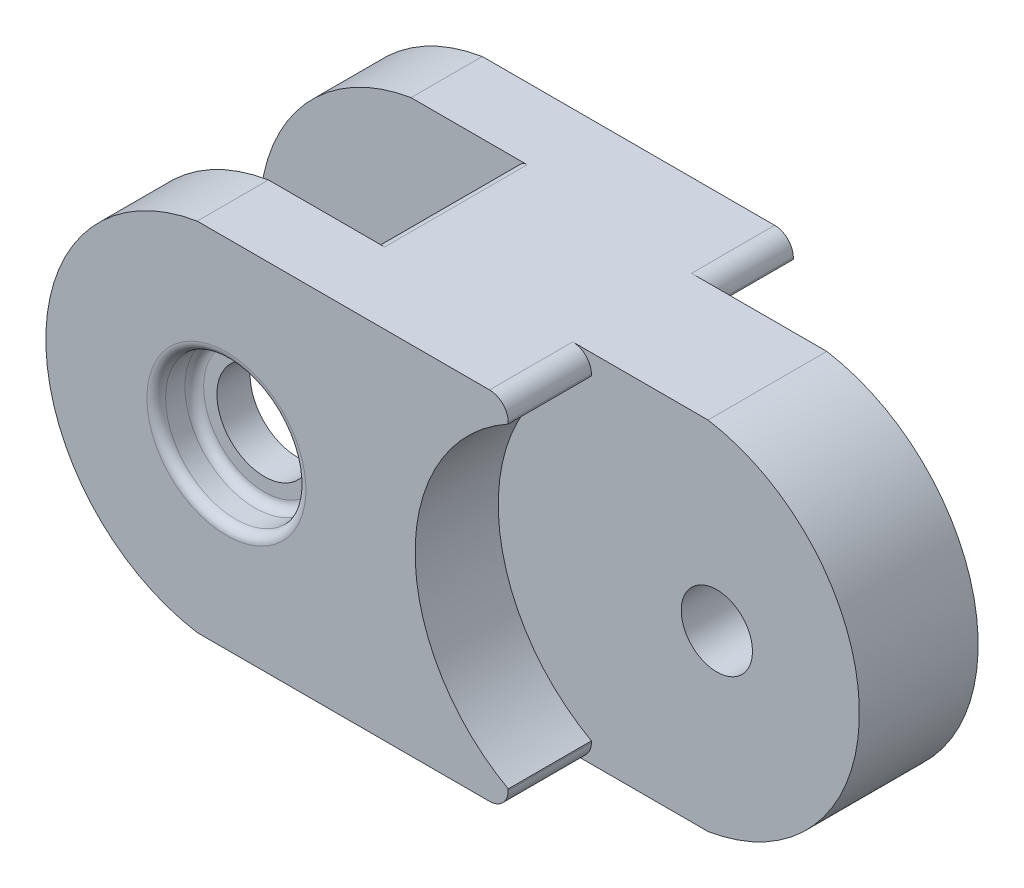
ISO-10303-21;
HEADER;
FILE_DESCRIPTION(('STEP AP214'),'2;1');
FILE_NAME('part.step','',(''),(''),'','','');
FILE_SCHEMA(('AUTOMOTIVE_DESIGN { 1 0 10303 214 1 1 1 1 }'));
ENDSEC;
DATA;
#1=APPLICATION_CONTEXT('core data for automotive mechanical design processes');
#2=APPLICATION_PROTOCOL_DEFINITION('international standard','automotive_design',2000,#1);
#3=PRODUCT_CONTEXT('',#1,'mechanical');
#4=PRODUCT('Part','Part','',(#3));
#5=PRODUCT_RELATED_PRODUCT_CATEGORY('part','',(#4));
#6=PRODUCT_DEFINITION_FORMATION('','',#4);
#7=PRODUCT_DEFINITION_CONTEXT('part definition',#1,'design');
#8=PRODUCT_DEFINITION('design','',#6,#7);
#9=PRODUCT_DEFINITION_SHAPE('','',#8);
#10=(LENGTH_UNIT() NAMED_UNIT(*) SI_UNIT(.MILLI.,.METRE.));
#11=(NAMED_UNIT(*) PLANE_ANGLE_UNIT() SI_UNIT($,.RADIAN.));
#12=(NAMED_UNIT(*) SI_UNIT($,.STERADIAN.) SOLID_ANGLE_UNIT());
#13=UNCERTAINTY_MEASURE_WITH_UNIT(LENGTH_MEASURE(1.E-05),#10,'distance_accuracy_value','');
#14=(GEOMETRIC_REPRESENTATION_CONTEXT(3) GLOBAL_UNCERTAINTY_ASSIGNED_CONTEXT((#13)) GLOBAL_UNIT_ASSIGNED_CONTEXT((#10,
#11,#12)) REPRESENTATION_CONTEXT('',''));
#15=CARTESIAN_POINT('',(0.,0.,0.));
#16=DIRECTION('',(0.,0.,1.));
#17=DIRECTION('',(1.,0.,0.));
#18=AXIS2_PLACEMENT_3D('',#15,#16,#17);
#19=CARTESIAN_POINT('',(0.,19.05,0.));
#20=DIRECTION('',(0.,-1.,0.));
#21=DIRECTION('',(0.,0.,-1.));
#22=AXIS2_PLACEMENT_3D('',#19,#20,#21);
#23=PLANE('',#22);
#24=DIRECTION('',(-1.,0.,0.));
#25=VECTOR('',#24,1.);
#26=CARTESIAN_POINT('',(0.,19.05,-3.175));
#27=LINE('',#26,#25);
#28=CARTESIAN_POINT('',(11.43,19.05,-3.175));
#29=VERTEX_POINT('',#28);
#30=CARTESIAN_POINT('',(4.19698559221496,19.05,-3.175));
#31=VERTEX_POINT('',#30);
#32=EDGE_CURVE('E223',#29,#31,#27,.T.);
#33=ORIENTED_EDGE('',*,*,#32,.T.);
#34=DIRECTION('',(0.,0.,1.));
#35=VECTOR('',#34,1.);
#36=CARTESIAN_POINT('',(4.19698559221496,19.05,0.));
#37=LINE('',#36,#35);
#38=CARTESIAN_POINT('',(4.19698559221496,19.05,-7.62));
#39=VERTEX_POINT('',#38);
#40=EDGE_CURVE('E364',#31,#39,#37,.F.);
#41=ORIENTED_EDGE('',*,*,#40,.T.);
#42=DIRECTION('',(1.,0.,0.));
#43=VECTOR('',#42,1.);
#44=CARTESIAN_POINT('',(-11.43,19.05,-7.62));
#45=LINE('',#44,#43);
#46=CARTESIAN_POINT('',(-11.43,19.05,-7.62));
#47=VERTEX_POINT('',#46);
#48=EDGE_CURVE('E288',#47,#39,#45,.T.);
#49=ORIENTED_EDGE('',*,*,#48,.F.);
#50=DIRECTION('',(0.,0.,1.));
#51=VECTOR('',#50,1.);
#52=CARTESIAN_POINT('',(-11.43,19.05,-7.62));
#53=LINE('',#52,#51);
#54=CARTESIAN_POINT('',(-11.43,19.05,-3.81));
#55=VERTEX_POINT('',#54);
#56=EDGE_CURVE('E273',#47,#55,#53,.T.);
#57=ORIENTED_EDGE('',*,*,#56,.T.);
#58=DIRECTION('',(1.,0.,0.));
#59=VECTOR('',#58,1.);
#60=CARTESIAN_POINT('',(0.,19.05,-3.81));
#61=LINE('',#60,#59);
#62=CARTESIAN_POINT('',(-5.22047552437083,19.05,-3.81));
#63=VERTEX_POINT('',#62);
#64=EDGE_CURVE('E262',#55,#63,#61,.T.);
#65=ORIENTED_EDGE('',*,*,#64,.T.);
#66=DIRECTION('',(0.,0.,1.));
#67=VECTOR('',#66,1.);
#68=CARTESIAN_POINT('',(-5.22047552437083,19.05,0.));
#69=LINE('',#68,#67);
#70=CARTESIAN_POINT('',(-5.22047552437083,19.05,3.81));
#71=VERTEX_POINT('',#70);
#72=EDGE_CURVE('E316',#63,#71,#69,.T.);
#73=ORIENTED_EDGE('',*,*,#72,.T.);
#74=DIRECTION('',(1.,0.,0.));
#75=VECTOR('',#74,1.);
#76=CARTESIAN_POINT('',(0.,19.05,3.81));
#77=LINE('',#76,#75);
#78=CARTESIAN_POINT('',(-11.43,19.05,3.81));
#79=VERTEX_POINT('',#78);
#80=EDGE_CURVE('E258',#79,#71,#77,.T.);
#81=ORIENTED_EDGE('',*,*,#80,.F.);
#82=DIRECTION('',(0.,0.,-1.));
#83=VECTOR('',#82,1.);
#84=CARTESIAN_POINT('',(-11.43,19.05,7.62));
#85=LINE('',#84,#83);
#86=CARTESIAN_POINT('',(-11.43,19.05,7.62));
#87=VERTEX_POINT('',#86);
#88=EDGE_CURVE('E285',#87,#79,#85,.T.);
#89=ORIENTED_EDGE('',*,*,#88,.F.);
#90=DIRECTION('',(1.,0.,0.));
#91=VECTOR('',#90,1.);
#92=CARTESIAN_POINT('',(-11.43,19.05,7.62));
#93=LINE('',#92,#91);
#94=CARTESIAN_POINT('',(4.19698559221499,19.05,7.62));
#95=VERTEX_POINT('',#94);
#96=EDGE_CURVE('E292',#87,#95,#93,.T.);
#97=ORIENTED_EDGE('',*,*,#96,.T.);
#98=DIRECTION('',(0.,0.,1.));
#99=VECTOR('',#98,1.);
#100=CARTESIAN_POINT('',(4.19698559221499,19.05,0.));
#101=LINE('',#100,#99);
#102=CARTESIAN_POINT('',(4.19698559221499,19.05,3.175));
#103=VERTEX_POINT('',#102);
#104=EDGE_CURVE('E361',#95,#103,#101,.F.);
#105=ORIENTED_EDGE('',*,*,#104,.T.);
#106=DIRECTION('',(-1.,0.,0.));
#107=VECTOR('',#106,1.);
#108=CARTESIAN_POINT('',(0.,19.05,3.175));
#109=LINE('',#108,#107);
#110=CARTESIAN_POINT('',(11.43,19.05,3.175));
#111=VERTEX_POINT('',#110);
#112=EDGE_CURVE('E233',#111,#103,#109,.T.);
#113=ORIENTED_EDGE('',*,*,#112,.F.);
#114=DIRECTION('',(0.,0.,-1.));
#115=VECTOR('',#114,1.);
#116=CARTESIAN_POINT('',(11.43,19.05,3.175));
#117=LINE('',#116,#115);
#118=EDGE_CURVE('E247',#111,#29,#117,.T.);
#119=ORIENTED_EDGE('',*,*,#118,.T.);
#120=EDGE_LOOP('',(#33,#41,#49,#57,#65,#73,#81,#89,#97,#105,#113,#119));
#121=FACE_BOUND('',#120,.T.);
#122=ADVANCED_FACE('F38',(#121),#23,.F.);
#123=CARTESIAN_POINT('',(0.,0.,0.));
#124=DIRECTION('',(0.,-1.,0.));
#125=DIRECTION('',(0.,0.,-1.));
#126=AXIS2_PLACEMENT_3D('',#123,#124,#125);
#127=PLANE('',#126);
#128=DIRECTION('',(1.,0.,0.));
#129=VECTOR('',#128,1.);
#130=CARTESIAN_POINT('',(-11.43,0.,-7.62));
#131=LINE('',#130,#129);
#132=CARTESIAN_POINT('',(-11.43,0.,-7.62));
#133=VERTEX_POINT('',#132);
#134=CARTESIAN_POINT('',(4.19698559221496,0.,-7.62));
#135=VERTEX_POINT('',#134);
#136=EDGE_CURVE('E298',#133,#135,#131,.T.);
#137=ORIENTED_EDGE('',*,*,#136,.T.);
#138=DIRECTION('',(0.,0.,1.));
#139=VECTOR('',#138,1.);
#140=CARTESIAN_POINT('',(4.19698559221496,0.,-3.175));
#141=LINE('',#140,#139);
#142=CARTESIAN_POINT('',(4.19698559221496,0.,-3.175));
#143=VERTEX_POINT('',#142);
#144=EDGE_CURVE('E350',#135,#143,#141,.T.);
#145=ORIENTED_EDGE('',*,*,#144,.T.);
#146=DIRECTION('',(-1.,0.,0.));
#147=VECTOR('',#146,1.);
#148=CARTESIAN_POINT('',(0.,0.,-3.175));
#149=LINE('',#148,#147);
#150=CARTESIAN_POINT('',(11.43,0.,-3.175));
#151=VERTEX_POINT('',#150);
#152=EDGE_CURVE('E216',#151,#143,#149,.T.);
#153=ORIENTED_EDGE('',*,*,#152,.F.);
#154=DIRECTION('',(0.,0.,-1.));
#155=VECTOR('',#154,1.);
#156=CARTESIAN_POINT('',(11.43,0.,3.175));
#157=LINE('',#156,#155);
#158=CARTESIAN_POINT('',(11.43,0.,3.175));
#159=VERTEX_POINT('',#158);
#160=EDGE_CURVE('E242',#159,#151,#157,.T.);
#161=ORIENTED_EDGE('',*,*,#160,.F.);
#162=DIRECTION('',(-1.,0.,0.));
#163=VECTOR('',#162,1.);
#164=CARTESIAN_POINT('',(0.,0.,3.175));
#165=LINE('',#164,#163);
#166=CARTESIAN_POINT('',(4.19698559221499,0.,3.175));
#167=VERTEX_POINT('',#166);
#168=EDGE_CURVE('E229',#159,#167,#165,.T.);
#169=ORIENTED_EDGE('',*,*,#168,.T.);
#170=DIRECTION('',(0.,0.,1.));
#171=VECTOR('',#170,1.);
#172=CARTESIAN_POINT('',(4.19698559221499,0.,7.62));
#173=LINE('',#172,#171);
#174=CARTESIAN_POINT('',(4.19698559221499,0.,7.62));
#175=VERTEX_POINT('',#174);
#176=EDGE_CURVE('E347',#167,#175,#173,.T.);
#177=ORIENTED_EDGE('',*,*,#176,.T.);
#178=DIRECTION('',(1.,0.,0.));
#179=VECTOR('',#178,1.);
#180=CARTESIAN_POINT('',(-11.43,0.,7.62));
#181=LINE('',#180,#179);
#182=CARTESIAN_POINT('',(-11.43,0.,7.62));
#183=VERTEX_POINT('',#182);
#184=EDGE_CURVE('E289',#183,#175,#181,.T.);
#185=ORIENTED_EDGE('',*,*,#184,.F.);
#186=DIRECTION('',(0.,0.,-1.));
#187=VECTOR('',#186,1.);
#188=CARTESIAN_POINT('',(-11.43,0.,7.62));
#189=LINE('',#188,#187);
#190=CARTESIAN_POINT('',(-11.43,0.,3.81));
#191=VERTEX_POINT('',#190);
#192=EDGE_CURVE('E282',#183,#191,#189,.T.);
#193=ORIENTED_EDGE('',*,*,#192,.T.);
#194=DIRECTION('',(1.,0.,0.));
#195=VECTOR('',#194,1.);
#196=CARTESIAN_POINT('',(0.,0.,3.81));
#197=LINE('',#196,#195);
#198=CARTESIAN_POINT('',(-5.22047552437083,0.,3.81));
#199=VERTEX_POINT('',#198);
#200=EDGE_CURVE('E254',#191,#199,#197,.T.);
#201=ORIENTED_EDGE('',*,*,#200,.T.);
#202=DIRECTION('',(0.,0.,-1.));
#203=VECTOR('',#202,1.);
#204=CARTESIAN_POINT('',(-5.22047552437083,0.,-3.81));
#205=LINE('',#204,#203);
#206=CARTESIAN_POINT('',(-5.22047552437083,0.,-3.81));
#207=VERTEX_POINT('',#206);
#208=EDGE_CURVE('E313',#199,#207,#205,.T.);
#209=ORIENTED_EDGE('',*,*,#208,.T.);
#210=DIRECTION('',(1.,0.,0.));
#211=VECTOR('',#210,1.);
#212=CARTESIAN_POINT('',(0.,0.,-3.81));
#213=LINE('',#212,#211);
#214=CARTESIAN_POINT('',(-11.43,0.,-3.81));
#215=VERTEX_POINT('',#214);
#216=EDGE_CURVE('E260',#215,#207,#213,.T.);
#217=ORIENTED_EDGE('',*,*,#216,.F.);
#218=DIRECTION('',(0.,0.,1.));
#219=VECTOR('',#218,1.);
#220=CARTESIAN_POINT('',(-11.43,0.,-7.62));
#221=LINE('',#220,#219);
#222=EDGE_CURVE('E270',#133,#215,#221,.T.);
#223=ORIENTED_EDGE('',*,*,#222,.F.);
#224=EDGE_LOOP('',(#137,#145,#153,#161,#169,#177,#185,#193,#201,#209,#217,#223));
#225=FACE_BOUND('',#224,.T.);
#226=ADVANCED_FACE('F389',(#225),#127,.T.);
#227=CARTESIAN_POINT('',(-11.43,19.05,-7.62));
#228=DIRECTION('',(0.,0.,-1.));
#229=DIRECTION('',(-1.,0.,0.));
#230=AXIS2_PLACEMENT_3D('',#227,#228,#229);
#231=PLANE('',#230);
#232=DIRECTION('',(0.,1.,0.));
#233=VECTOR('',#232,1.);
#234=CARTESIAN_POINT('',(5.19698559221496,-5.4259918382174,-7.62));
#235=LINE('',#234,#233);
#236=CARTESIAN_POINT('',(5.19698559221496,0.999999999999998,-7.62));
#237=VERTEX_POINT('',#236);
#238=CARTESIAN_POINT('',(5.19698559221497,1.07931071599416,-7.62));
#239=VERTEX_POINT('',#238);
#240=EDGE_CURVE('E186',#237,#239,#235,.T.);
#241=ORIENTED_EDGE('',*,*,#240,.F.);
#242=CARTESIAN_POINT('',(4.19698559221496,1.,-7.62));
#243=DIRECTION('',(0.,0.,-1.));
#244=DIRECTION('',(-1.,0.,0.));
#245=AXIS2_PLACEMENT_3D('',#242,#243,#244);
#246=CIRCLE('',#245,1.);
#247=EDGE_CURVE('E356',#237,#135,#246,.T.);
#248=ORIENTED_EDGE('',*,*,#247,.T.);
#249=ORIENTED_EDGE('',*,*,#136,.F.);
#250=CARTESIAN_POINT('',(-9.86939787261456,9.525,-7.62));
#251=DIRECTION('',(0.,0.,1.));
#252=DIRECTION('',(1.,0.,0.));
#253=AXIS2_PLACEMENT_3D('',#250,#251,#252);
#254=CIRCLE('',#253,9.652);
#255=EDGE_CURVE('E268',#47,#133,#254,.T.);
#256=ORIENTED_EDGE('',*,*,#255,.F.);
#257=ORIENTED_EDGE('',*,*,#48,.T.);
#258=CARTESIAN_POINT('',(4.19698559221496,18.05,-7.62));
#259=DIRECTION('',(0.,0.,-1.));
#260=DIRECTION('',(-1.,0.,0.));
#261=AXIS2_PLACEMENT_3D('',#258,#259,#260);
#262=CIRCLE('',#261,1.);
#263=CARTESIAN_POINT('',(5.19698559221496,18.05,-7.62));
#264=VERTEX_POINT('',#263);
#265=EDGE_CURVE('E354',#39,#264,#262,.T.);
#266=ORIENTED_EDGE('',*,*,#265,.T.);
#267=CARTESIAN_POINT('',(5.19698559221497,17.9706892840058,-7.62));
#268=VERTEX_POINT('',#267);
#269=EDGE_CURVE('E198',#268,#264,#235,.T.);
#270=ORIENTED_EDGE('',*,*,#269,.F.);
#271=CARTESIAN_POINT('',(9.86939787261456,9.525,-7.62));
#272=DIRECTION('',(0.,0.,1.));
#273=DIRECTION('',(1.,0.,0.));
#274=AXIS2_PLACEMENT_3D('',#271,#272,#273);
#275=CIRCLE('',#274,9.652);
#276=EDGE_CURVE('E204',#268,#239,#275,.T.);
#277=ORIENTED_EDGE('',*,*,#276,.T.);
#278=EDGE_LOOP('',(#241,#248,#249,#256,#257,#266,#270,#277));
#279=FACE_BOUND('',#278,.T.);
#280=CARTESIAN_POINT('',(-9.86939787261456,9.525,-7.62));
#281=DIRECTION('',(0.,0.,1.));
#282=DIRECTION('',(1.,0.,0.));
#283=AXIS2_PLACEMENT_3D('',#280,#281,#282);
#284=CIRCLE('',#283,1.905);
#285=CARTESIAN_POINT('',(-7.96439787261455,9.525,-7.62));
#286=VERTEX_POINT('',#285);
#287=EDGE_CURVE('E264',#286,#286,#284,.T.);
#288=ORIENTED_EDGE('',*,*,#287,.T.);
#289=EDGE_LOOP('',(#288));
#290=FACE_BOUND('',#289,.T.);
#291=ADVANCED_FACE('F211',(#279,#290),#231,.T.);
#292=CARTESIAN_POINT('',(-11.43,19.05,7.62));
#293=DIRECTION('',(0.,0.,-1.));
#294=DIRECTION('',(-1.,0.,0.));
#295=AXIS2_PLACEMENT_3D('',#292,#293,#294);
#296=PLANE('',#295);
#297=CARTESIAN_POINT('',(-9.86939787261456,9.525,7.62));
#298=DIRECTION('',(0.,0.,-1.));
#299=DIRECTION('',(-1.,0.,0.));
#300=AXIS2_PLACEMENT_3D('',#297,#298,#299);
#301=CIRCLE('',#300,4.2500052);
#302=CARTESIAN_POINT('',(-14.1194030726146,9.525,7.62));
#303=VERTEX_POINT('',#302);
#304=EDGE_CURVE('E338',#303,#303,#301,.T.);
#305=ORIENTED_EDGE('',*,*,#304,.T.);
#306=EDGE_LOOP('',(#305));
#307=FACE_BOUND('',#306,.T.);
#308=ORIENTED_EDGE('',*,*,#184,.T.);
#309=CARTESIAN_POINT('',(4.19698559221499,1.,7.62));
#310=DIRECTION('',(0.,0.,-1.));
#311=DIRECTION('',(-1.,0.,0.));
#312=AXIS2_PLACEMENT_3D('',#309,#310,#311);
#313=CIRCLE('',#312,1.);
#314=CARTESIAN_POINT('',(5.19698559221499,1.,7.62));
#315=VERTEX_POINT('',#314);
#316=EDGE_CURVE('E368',#175,#315,#313,.F.);
#317=ORIENTED_EDGE('',*,*,#316,.T.);
#318=DIRECTION('',(0.,1.,0.));
#319=VECTOR('',#318,1.);
#320=CARTESIAN_POINT('',(5.19698559221499,-5.4259918382174,7.62));
#321=LINE('',#320,#319);
#322=CARTESIAN_POINT('',(5.19698559221499,1.07931071599415,7.62));
#323=VERTEX_POINT('',#322);
#324=EDGE_CURVE('E440',#315,#323,#321,.T.);
#325=ORIENTED_EDGE('',*,*,#324,.T.);
#326=CARTESIAN_POINT('',(9.86939787261456,9.525,7.62));
#327=DIRECTION('',(0.,0.,1.));
#328=DIRECTION('',(1.,0.,0.));
#329=AXIS2_PLACEMENT_3D('',#326,#327,#328);
#330=CIRCLE('',#329,9.652);
#331=CARTESIAN_POINT('',(5.19698559221499,17.9706892840059,7.62));
#332=VERTEX_POINT('',#331);
#333=EDGE_CURVE('E226',#332,#323,#330,.T.);
#334=ORIENTED_EDGE('',*,*,#333,.F.);
#335=CARTESIAN_POINT('',(5.19698559221499,18.05,7.62));
#336=VERTEX_POINT('',#335);
#337=EDGE_CURVE('E197',#332,#336,#321,.T.);
#338=ORIENTED_EDGE('',*,*,#337,.T.);
#339=CARTESIAN_POINT('',(4.19698559221499,18.05,7.62));
#340=DIRECTION('',(0.,0.,-1.));
#341=DIRECTION('',(-1.,0.,0.));
#342=AXIS2_PLACEMENT_3D('',#339,#340,#341);
#343=CIRCLE('',#342,1.);
#344=EDGE_CURVE('E366',#336,#95,#343,.F.);
#345=ORIENTED_EDGE('',*,*,#344,.T.);
#346=ORIENTED_EDGE('',*,*,#96,.F.);
#347=CARTESIAN_POINT('',(-9.86939787261456,9.525,7.62));
#348=DIRECTION('',(0.,0.,1.));
#349=DIRECTION('',(1.,0.,0.));
#350=AXIS2_PLACEMENT_3D('',#347,#348,#349);
#351=CIRCLE('',#350,9.652);
#352=EDGE_CURVE('E276',#87,#183,#351,.T.);
#353=ORIENTED_EDGE('',*,*,#352,.T.);
#354=EDGE_LOOP('',(#308,#317,#325,#334,#338,#345,#346,#353));
#355=FACE_BOUND('',#354,.T.);
#356=ADVANCED_FACE('F391',(#307,#355),#296,.F.);
#357=CARTESIAN_POINT('',(-9.86939787261456,9.525,3.81));
#358=DIRECTION('',(0.,0.,1.));
#359=DIRECTION('',(1.,0.,0.));
#360=AXIS2_PLACEMENT_3D('',#357,#358,#359);
#361=CYLINDRICAL_SURFACE('',#360,9.652);
#362=ORIENTED_EDGE('',*,*,#352,.F.);
#363=ORIENTED_EDGE('',*,*,#88,.T.);
#364=CARTESIAN_POINT('',(-9.86939787261456,9.525,3.81));
#365=DIRECTION('',(0.,0.,1.));
#366=DIRECTION('',(1.,0.,0.));
#367=AXIS2_PLACEMENT_3D('',#364,#365,#366);
#368=CIRCLE('',#367,9.652);
#369=EDGE_CURVE('E279',#79,#191,#368,.T.);
#370=ORIENTED_EDGE('',*,*,#369,.T.);
#371=ORIENTED_EDGE('',*,*,#192,.F.);
#372=EDGE_LOOP('',(#362,#363,#370,#371));
#373=FACE_BOUND('',#372,.T.);
#374=ADVANCED_FACE('F395',(#373),#361,.T.);
#375=CARTESIAN_POINT('',(-9.86939787261456,9.525,3.81));
#376=DIRECTION('',(0.,0.,1.));
#377=DIRECTION('',(1.,0.,0.));
#378=AXIS2_PLACEMENT_3D('',#375,#376,#377);
#379=PLANE('',#378);
#380=CARTESIAN_POINT('',(-9.86939787261456,9.525,3.81));
#381=DIRECTION('',(0.,0.,1.));
#382=DIRECTION('',(1.,0.,0.));
#383=AXIS2_PLACEMENT_3D('',#380,#381,#382);
#384=CIRCLE('',#383,2.54);
#385=CARTESIAN_POINT('',(-7.32939787261455,9.525,3.81));
#386=VERTEX_POINT('',#385);
#387=EDGE_CURVE('E214',#386,#386,#384,.F.);
#388=ORIENTED_EDGE('',*,*,#387,.F.);
#389=EDGE_LOOP('',(#388));
#390=FACE_BOUND('',#389,.T.);
#391=ORIENTED_EDGE('',*,*,#369,.F.);
#392=ORIENTED_EDGE('',*,*,#80,.T.);
#393=CARTESIAN_POINT('',(-5.22047552437083,18.55,3.81));
#394=DIRECTION('',(0.,0.,1.));
#395=DIRECTION('',(1.,0.,0.));
#396=AXIS2_PLACEMENT_3D('',#393,#394,#395);
#397=CIRCLE('',#396,0.5);
#398=CARTESIAN_POINT('',(-5.44944136106526,18.1055063041765,3.81));
#399=VERTEX_POINT('',#398);
#400=EDGE_CURVE('E324',#71,#399,#397,.T.);
#401=ORIENTED_EDGE('',*,*,#400,.T.);
#402=CARTESIAN_POINT('',(-9.86939787261455,9.525,3.81));
#403=DIRECTION('',(0.,0.,1.));
#404=DIRECTION('',(-1.,0.,0.));
#405=AXIS2_PLACEMENT_3D('',#402,#403,#404);
#406=CIRCLE('',#405,9.652);
#407=CARTESIAN_POINT('',(-5.44944136106526,0.944493695823483,3.81));
#408=VERTEX_POINT('',#407);
#409=EDGE_CURVE('E250',#408,#399,#406,.T.);
#410=ORIENTED_EDGE('',*,*,#409,.F.);
#411=CARTESIAN_POINT('',(-5.22047552437083,0.5,3.81));
#412=DIRECTION('',(0.,0.,1.));
#413=DIRECTION('',(1.,0.,0.));
#414=AXIS2_PLACEMENT_3D('',#411,#412,#413);
#415=CIRCLE('',#414,0.5);
#416=EDGE_CURVE('E319',#408,#199,#415,.T.);
#417=ORIENTED_EDGE('',*,*,#416,.T.);
#418=ORIENTED_EDGE('',*,*,#200,.F.);
#419=EDGE_LOOP('',(#391,#392,#401,#410,#417,#418));
#420=FACE_BOUND('',#419,.T.);
#421=ADVANCED_FACE('F401',(#390,#420),#379,.F.);
#422=CARTESIAN_POINT('',(-9.86939787261456,9.525,-7.62));
#423=DIRECTION('',(0.,0.,1.));
#424=DIRECTION('',(1.,0.,0.));
#425=AXIS2_PLACEMENT_3D('',#422,#423,#424);
#426=CYLINDRICAL_SURFACE('',#425,9.652);
#427=CARTESIAN_POINT('',(-9.86939787261456,9.525,-3.81));
#428=DIRECTION('',(0.,0.,1.));
#429=DIRECTION('',(1.,0.,0.));
#430=AXIS2_PLACEMENT_3D('',#427,#428,#429);
#431=CIRCLE('',#430,9.652);
#432=EDGE_CURVE('E267',#55,#215,#431,.T.);
#433=ORIENTED_EDGE('',*,*,#432,.F.);
#434=ORIENTED_EDGE('',*,*,#56,.F.);
#435=ORIENTED_EDGE('',*,*,#255,.T.);
#436=ORIENTED_EDGE('',*,*,#222,.T.);
#437=EDGE_LOOP('',(#433,#434,#435,#436));
#438=FACE_BOUND('',#437,.T.);
#439=ADVANCED_FACE('F420',(#438),#426,.T.);
#440=CARTESIAN_POINT('',(-9.86939787261456,9.525,-3.81));
#441=DIRECTION('',(0.,0.,1.));
#442=DIRECTION('',(1.,0.,0.));
#443=AXIS2_PLACEMENT_3D('',#440,#441,#442);
#444=PLANE('',#443);
#445=ORIENTED_EDGE('',*,*,#64,.F.);
#446=ORIENTED_EDGE('',*,*,#432,.T.);
#447=ORIENTED_EDGE('',*,*,#216,.T.);
#448=CARTESIAN_POINT('',(-5.22047552437083,0.5,-3.81));
#449=DIRECTION('',(0.,0.,1.));
#450=DIRECTION('',(1.,0.,0.));
#451=AXIS2_PLACEMENT_3D('',#448,#449,#450);
#452=CIRCLE('',#451,0.5);
#453=CARTESIAN_POINT('',(-5.44944136106526,0.944493695823483,-3.81));
#454=VERTEX_POINT('',#453);
#455=EDGE_CURVE('E322',#207,#454,#452,.F.);
#456=ORIENTED_EDGE('',*,*,#455,.T.);
#457=CARTESIAN_POINT('',(-9.86939787261455,9.525,-3.81));
#458=DIRECTION('',(0.,0.,1.));
#459=DIRECTION('',(-1.,0.,0.));
#460=AXIS2_PLACEMENT_3D('',#457,#458,#459);
#461=CIRCLE('',#460,9.652);
#462=CARTESIAN_POINT('',(-5.44944136106526,18.1055063041765,-3.81));
#463=VERTEX_POINT('',#462);
#464=EDGE_CURVE('E251',#454,#463,#461,.T.);
#465=ORIENTED_EDGE('',*,*,#464,.T.);
#466=CARTESIAN_POINT('',(-5.22047552437083,18.55,-3.81));
#467=DIRECTION('',(0.,0.,1.));
#468=DIRECTION('',(1.,0.,0.));
#469=AXIS2_PLACEMENT_3D('',#466,#467,#468);
#470=CIRCLE('',#469,0.5);
#471=EDGE_CURVE('E326',#463,#63,#470,.F.);
#472=ORIENTED_EDGE('',*,*,#471,.T.);
#473=EDGE_LOOP('',(#445,#446,#447,#456,#465,#472));
#474=FACE_BOUND('',#473,.T.);
#475=CARTESIAN_POINT('',(-9.86939787261456,9.525,-3.81));
#476=DIRECTION('',(0.,0.,1.));
#477=DIRECTION('',(1.,0.,0.));
#478=AXIS2_PLACEMENT_3D('',#475,#476,#477);
#479=CIRCLE('',#478,1.905);
#480=CARTESIAN_POINT('',(-7.96439787261455,9.525,-3.81));
#481=VERTEX_POINT('',#480);
#482=EDGE_CURVE('E295',#481,#481,#479,.T.);
#483=ORIENTED_EDGE('',*,*,#482,.F.);
#484=EDGE_LOOP('',(#483));
#485=FACE_BOUND('',#484,.T.);
#486=ADVANCED_FACE('F407',(#474,#485),#444,.T.);
#487=CARTESIAN_POINT('',(-9.86939787261456,9.525,-7.62));
#488=DIRECTION('',(0.,0.,1.));
#489=DIRECTION('',(1.,0.,0.));
#490=AXIS2_PLACEMENT_3D('',#487,#488,#489);
#491=CYLINDRICAL_SURFACE('',#490,1.905);
#492=ORIENTED_EDGE('',*,*,#287,.F.);
#493=EDGE_LOOP('',(#492));
#494=FACE_BOUND('',#493,.T.);
#495=ORIENTED_EDGE('',*,*,#482,.T.);
#496=EDGE_LOOP('',(#495));
#497=FACE_BOUND('',#496,.T.);
#498=ADVANCED_FACE('F533',(#494,#497),#491,.F.);
#499=CARTESIAN_POINT('',(-9.86939787261455,9.525,-3.81));
#500=DIRECTION('',(0.,0.,1.));
#501=DIRECTION('',(1.,0.,0.));
#502=AXIS2_PLACEMENT_3D('',#499,#500,#501);
#503=CYLINDRICAL_SURFACE('',#502,9.652);
#504=ORIENTED_EDGE('',*,*,#464,.F.);
#505=DIRECTION('',(0.,0.,1.));
#506=VECTOR('',#505,1.);
#507=CARTESIAN_POINT('',(-5.44944136106526,0.944493695823483,-3.81));
#508=LINE('',#507,#506);
#509=EDGE_CURVE('E310',#454,#408,#508,.T.);
#510=ORIENTED_EDGE('',*,*,#509,.T.);
#511=ORIENTED_EDGE('',*,*,#409,.T.);
#512=DIRECTION('',(0.,0.,1.));
#513=VECTOR('',#512,1.);
#514=CARTESIAN_POINT('',(-5.44944136106526,18.1055063041765,-3.81));
#515=LINE('',#514,#513);
#516=EDGE_CURVE('E308',#399,#463,#515,.F.);
#517=ORIENTED_EDGE('',*,*,#516,.T.);
#518=EDGE_LOOP('',(#504,#510,#511,#517));
#519=FACE_BOUND('',#518,.T.);
#520=ADVANCED_FACE('F411',(#519),#503,.F.);
#521=CARTESIAN_POINT('',(9.86939787261456,9.525,3.175));
#522=DIRECTION('',(0.,0.,-1.));
#523=DIRECTION('',(-1.,0.,0.));
#524=AXIS2_PLACEMENT_3D('',#521,#522,#523);
#525=CYLINDRICAL_SURFACE('',#524,9.652);
#526=CARTESIAN_POINT('',(9.86939787261456,9.525,-3.175));
#527=DIRECTION('',(0.,0.,1.));
#528=DIRECTION('',(-1.,0.,0.));
#529=AXIS2_PLACEMENT_3D('',#526,#527,#528);
#530=CIRCLE('',#529,9.652);
#531=EDGE_CURVE('E238',#151,#29,#530,.T.);
#532=ORIENTED_EDGE('',*,*,#531,.T.);
#533=ORIENTED_EDGE('',*,*,#118,.F.);
#534=CARTESIAN_POINT('',(9.86939787261456,9.525,3.175));
#535=DIRECTION('',(0.,0.,1.));
#536=DIRECTION('',(-1.,0.,0.));
#537=AXIS2_PLACEMENT_3D('',#534,#535,#536);
#538=CIRCLE('',#537,9.652);
#539=EDGE_CURVE('E239',#159,#111,#538,.T.);
#540=ORIENTED_EDGE('',*,*,#539,.F.);
#541=ORIENTED_EDGE('',*,*,#160,.T.);
#542=EDGE_LOOP('',(#532,#533,#540,#541));
#543=FACE_BOUND('',#542,.T.);
#544=ADVANCED_FACE('F539',(#543),#525,.T.);
#545=CARTESIAN_POINT('',(9.86939787261456,9.525,3.175));
#546=DIRECTION('',(0.,0.,-1.));
#547=DIRECTION('',(-1.,0.,0.));
#548=AXIS2_PLACEMENT_3D('',#545,#546,#547);
#549=PLANE('',#548);
#550=ORIENTED_EDGE('',*,*,#112,.T.);
#551=CARTESIAN_POINT('',(4.19698559221499,18.05,3.175));
#552=DIRECTION('',(0.,0.,-1.));
#553=DIRECTION('',(-1.,0.,0.));
#554=AXIS2_PLACEMENT_3D('',#551,#552,#553);
#555=CIRCLE('',#554,1.);
#556=CARTESIAN_POINT('',(5.19698559221499,18.05,3.175));
#557=VERTEX_POINT('',#556);
#558=EDGE_CURVE('E11',#103,#557,#555,.T.);
#559=ORIENTED_EDGE('',*,*,#558,.T.);
#560=DIRECTION('',(0.,1.,0.));
#561=VECTOR('',#560,1.);
#562=CARTESIAN_POINT('',(5.19698559221499,-5.4259918382174,3.175));
#563=LINE('',#562,#561);
#564=CARTESIAN_POINT('',(5.19698559221499,17.9706892840059,3.175));
#565=VERTEX_POINT('',#564);
#566=EDGE_CURVE('E442',#565,#557,#563,.T.);
#567=ORIENTED_EDGE('',*,*,#566,.F.);
#568=CARTESIAN_POINT('',(9.86939787261456,9.525,3.175));
#569=DIRECTION('',(0.,0.,1.));
#570=DIRECTION('',(1.,0.,0.));
#571=AXIS2_PLACEMENT_3D('',#568,#569,#570);
#572=CIRCLE('',#571,9.652);
#573=CARTESIAN_POINT('',(5.19698559221499,1.07931071599415,3.175));
#574=VERTEX_POINT('',#573);
#575=EDGE_CURVE('E225',#565,#574,#572,.T.);
#576=ORIENTED_EDGE('',*,*,#575,.T.);
#577=CARTESIAN_POINT('',(5.19698559221499,1.,3.175));
#578=VERTEX_POINT('',#577);
#579=EDGE_CURVE('E384',#578,#574,#563,.T.);
#580=ORIENTED_EDGE('',*,*,#579,.F.);
#581=CARTESIAN_POINT('',(4.19698559221499,1.,3.175));
#582=DIRECTION('',(0.,0.,-1.));
#583=DIRECTION('',(-1.,0.,0.));
#584=AXIS2_PLACEMENT_3D('',#581,#582,#583);
#585=CIRCLE('',#584,1.);
#586=EDGE_CURVE('E46',#578,#167,#585,.T.);
#587=ORIENTED_EDGE('',*,*,#586,.T.);
#588=ORIENTED_EDGE('',*,*,#168,.F.);
#589=ORIENTED_EDGE('',*,*,#539,.T.);
#590=EDGE_LOOP('',(#550,#559,#567,#576,#580,#587,#588,#589));
#591=FACE_BOUND('',#590,.T.);
#592=CARTESIAN_POINT('',(11.9013978726146,9.525,3.175));
#593=DIRECTION('',(0.,0.,1.));
#594=DIRECTION('',(1.,0.,0.));
#595=AXIS2_PLACEMENT_3D('',#592,#593,#594);
#596=CIRCLE('',#595,1.905);
#597=CARTESIAN_POINT('',(13.8063978726146,9.525,3.175));
#598=VERTEX_POINT('',#597);
#599=EDGE_CURVE('E235',#598,#598,#596,.T.);
#600=ORIENTED_EDGE('',*,*,#599,.F.);
#601=EDGE_LOOP('',(#600));
#602=FACE_BOUND('',#601,.T.);
#603=ADVANCED_FACE('F381',(#591,#602),#549,.F.);
#604=CARTESIAN_POINT('',(9.86939787261456,9.525,-3.175));
#605=DIRECTION('',(0.,0.,-1.));
#606=DIRECTION('',(-1.,0.,0.));
#607=AXIS2_PLACEMENT_3D('',#604,#605,#606);
#608=PLANE('',#607);
#609=ORIENTED_EDGE('',*,*,#152,.T.);
#610=CARTESIAN_POINT('',(4.19698559221496,1.,-3.175));
#611=DIRECTION('',(0.,0.,-1.));
#612=DIRECTION('',(-1.,0.,0.));
#613=AXIS2_PLACEMENT_3D('',#610,#611,#612);
#614=CIRCLE('',#613,1.);
#615=CARTESIAN_POINT('',(5.19698559221496,0.999999999999998,-3.175));
#616=VERTEX_POINT('',#615);
#617=EDGE_CURVE('E374',#143,#616,#614,.F.);
#618=ORIENTED_EDGE('',*,*,#617,.T.);
#619=DIRECTION('',(0.,1.,0.));
#620=VECTOR('',#619,1.);
#621=CARTESIAN_POINT('',(5.19698559221496,-5.4259918382174,-3.175));
#622=LINE('',#621,#620);
#623=CARTESIAN_POINT('',(5.19698559221496,1.07931071599416,-3.175));
#624=VERTEX_POINT('',#623);
#625=EDGE_CURVE('E437',#616,#624,#622,.T.);
#626=ORIENTED_EDGE('',*,*,#625,.T.);
#627=CARTESIAN_POINT('',(9.86939787261456,9.525,-3.175));
#628=DIRECTION('',(0.,0.,1.));
#629=DIRECTION('',(1.,0.,0.));
#630=AXIS2_PLACEMENT_3D('',#627,#628,#629);
#631=CIRCLE('',#630,9.652);
#632=CARTESIAN_POINT('',(5.19698559221497,17.9706892840058,-3.175));
#633=VERTEX_POINT('',#632);
#634=EDGE_CURVE('E206',#633,#624,#631,.T.);
#635=ORIENTED_EDGE('',*,*,#634,.F.);
#636=CARTESIAN_POINT('',(5.19698559221496,18.05,-3.175));
#637=VERTEX_POINT('',#636);
#638=EDGE_CURVE('E433',#633,#637,#622,.T.);
#639=ORIENTED_EDGE('',*,*,#638,.T.);
#640=CARTESIAN_POINT('',(4.19698559221496,18.05,-3.175));
#641=DIRECTION('',(0.,0.,-1.));
#642=DIRECTION('',(-1.,0.,0.));
#643=AXIS2_PLACEMENT_3D('',#640,#641,#642);
#644=CIRCLE('',#643,1.);
#645=EDGE_CURVE('E376',#637,#31,#644,.F.);
#646=ORIENTED_EDGE('',*,*,#645,.T.);
#647=ORIENTED_EDGE('',*,*,#32,.F.);
#648=ORIENTED_EDGE('',*,*,#531,.F.);
#649=EDGE_LOOP('',(#609,#618,#626,#635,#639,#646,#647,#648));
#650=FACE_BOUND('',#649,.T.);
#651=CARTESIAN_POINT('',(11.9013978726146,9.525,-3.175));
#652=DIRECTION('',(0.,0.,-1.));
#653=DIRECTION('',(-1.,0.,0.));
#654=AXIS2_PLACEMENT_3D('',#651,#652,#653);
#655=CIRCLE('',#654,1.905);
#656=CARTESIAN_POINT('',(9.99639787261455,9.525,-3.175));
#657=VERTEX_POINT('',#656);
#658=EDGE_CURVE('E305',#657,#657,#655,.T.);
#659=ORIENTED_EDGE('',*,*,#658,.F.);
#660=EDGE_LOOP('',(#659));
#661=FACE_BOUND('',#660,.T.);
#662=ADVANCED_FACE('F435',(#650,#661),#608,.T.);
#663=CARTESIAN_POINT('',(11.9013978726146,9.525,-3.175));
#664=DIRECTION('',(0.,0.,1.));
#665=DIRECTION('',(1.,0.,0.));
#666=AXIS2_PLACEMENT_3D('',#663,#664,#665);
#667=CYLINDRICAL_SURFACE('',#666,1.905);
#668=ORIENTED_EDGE('',*,*,#658,.T.);
#669=EDGE_LOOP('',(#668));
#670=FACE_BOUND('',#669,.T.);
#671=ORIENTED_EDGE('',*,*,#599,.T.);
#672=EDGE_LOOP('',(#671));
#673=FACE_BOUND('',#672,.T.);
#674=ADVANCED_FACE('F545',(#670,#673),#667,.F.);
#675=CARTESIAN_POINT('',(9.86939787261456,9.525,7.62));
#676=DIRECTION('',(0.,0.,-1.));
#677=DIRECTION('',(-1.,0.,0.));
#678=AXIS2_PLACEMENT_3D('',#675,#676,#677);
#679=CYLINDRICAL_SURFACE('',#678,9.652);
#680=DIRECTION('',(0.,0.,-1.));
#681=VECTOR('',#680,1.);
#682=CARTESIAN_POINT('',(5.19698559221499,17.9706892840059,7.62));
#683=LINE('',#682,#681);
#684=EDGE_CURVE('E208',#332,#565,#683,.T.);
#685=ORIENTED_EDGE('',*,*,#684,.F.);
#686=ORIENTED_EDGE('',*,*,#333,.T.);
#687=DIRECTION('',(0.,0.,-1.));
#688=VECTOR('',#687,1.);
#689=CARTESIAN_POINT('',(5.19698559221499,1.07931071599415,7.62));
#690=LINE('',#689,#688);
#691=EDGE_CURVE('E341',#574,#323,#690,.F.);
#692=ORIENTED_EDGE('',*,*,#691,.F.);
#693=ORIENTED_EDGE('',*,*,#575,.F.);
#694=EDGE_LOOP('',(#685,#686,#692,#693));
#695=FACE_BOUND('',#694,.T.);
#696=ADVANCED_FACE('F460',(#695),#679,.F.);
#697=CARTESIAN_POINT('',(9.86939787261456,9.525,-3.175));
#698=DIRECTION('',(0.,0.,-1.));
#699=DIRECTION('',(-1.,0.,0.));
#700=AXIS2_PLACEMENT_3D('',#697,#698,#699);
#701=CYLINDRICAL_SURFACE('',#700,9.652);
#702=DIRECTION('',(0.,0.,-1.));
#703=VECTOR('',#702,1.);
#704=CARTESIAN_POINT('',(5.19698559221497,17.9706892840058,-3.175));
#705=LINE('',#704,#703);
#706=EDGE_CURVE('E207',#633,#268,#705,.T.);
#707=ORIENTED_EDGE('',*,*,#706,.F.);
#708=ORIENTED_EDGE('',*,*,#634,.T.);
#709=DIRECTION('',(0.,0.,-1.));
#710=VECTOR('',#709,1.);
#711=CARTESIAN_POINT('',(5.19698559221497,1.07931071599416,-3.175));
#712=LINE('',#711,#710);
#713=EDGE_CURVE('E190',#239,#624,#712,.F.);
#714=ORIENTED_EDGE('',*,*,#713,.F.);
#715=ORIENTED_EDGE('',*,*,#276,.F.);
#716=EDGE_LOOP('',(#707,#708,#714,#715));
#717=FACE_BOUND('',#716,.T.);
#718=ADVANCED_FACE('F203',(#717),#701,.F.);
#719=CARTESIAN_POINT('',(-7.99439527261456,9.525,5.588));
#720=DIRECTION('',(0.,0.,-1.));
#721=DIRECTION('',(-1.,0.,0.));
#722=AXIS2_PLACEMENT_3D('',#719,#720,#721);
#723=PLANE('',#722);
#724=CARTESIAN_POINT('',(-9.86939787261456,9.525,5.588));
#725=DIRECTION('',(0.,0.,-1.));
#726=DIRECTION('',(-1.,0.,0.));
#727=AXIS2_PLACEMENT_3D('',#724,#725,#726);
#728=CIRCLE('',#727,3.2500052);
#729=CARTESIAN_POINT('',(-13.1194030726146,9.525,5.588));
#730=VERTEX_POINT('',#729);
#731=EDGE_CURVE('E329',#730,#730,#728,.F.);
#732=ORIENTED_EDGE('',*,*,#731,.T.);
#733=EDGE_LOOP('',(#732));
#734=FACE_BOUND('',#733,.T.);
#735=CARTESIAN_POINT('',(-9.86939787261456,9.525,5.588));
#736=DIRECTION('',(0.,0.,1.));
#737=DIRECTION('',(1.,0.,0.));
#738=AXIS2_PLACEMENT_3D('',#735,#736,#737);
#739=CIRCLE('',#738,2.54);
#740=CARTESIAN_POINT('',(-7.32939787261455,9.525,5.588));
#741=VERTEX_POINT('',#740);
#742=EDGE_CURVE('E219',#741,#741,#739,.T.);
#743=ORIENTED_EDGE('',*,*,#742,.F.);
#744=EDGE_LOOP('',(#743));
#745=FACE_BOUND('',#744,.T.);
#746=ADVANCED_FACE('F449',(#734,#745),#723,.F.);
#747=CARTESIAN_POINT('',(-9.86939787261456,9.525,7.62));
#748=DIRECTION('',(0.,0.,1.));
#749=DIRECTION('',(1.,0.,0.));
#750=AXIS2_PLACEMENT_3D('',#747,#748,#749);
#751=CYLINDRICAL_SURFACE('',#750,3.7500052);
#752=CARTESIAN_POINT('',(-9.86939787261456,9.525,6.088));
#753=DIRECTION('',(0.,0.,-1.));
#754=DIRECTION('',(-1.,0.,0.));
#755=AXIS2_PLACEMENT_3D('',#752,#753,#754);
#756=CIRCLE('',#755,3.7500052);
#757=CARTESIAN_POINT('',(-13.6194030726146,9.525,6.088));
#758=VERTEX_POINT('',#757);
#759=EDGE_CURVE('E335',#758,#758,#756,.T.);
#760=ORIENTED_EDGE('',*,*,#759,.T.);
#761=EDGE_LOOP('',(#760));
#762=FACE_BOUND('',#761,.T.);
#763=CARTESIAN_POINT('',(-9.86939787261456,9.525,7.12));
#764=DIRECTION('',(0.,0.,-1.));
#765=DIRECTION('',(-1.,0.,0.));
#766=AXIS2_PLACEMENT_3D('',#763,#764,#765);
#767=CIRCLE('',#766,3.7500052);
#768=CARTESIAN_POINT('',(-13.6194030726146,9.525,7.12));
#769=VERTEX_POINT('',#768);
#770=EDGE_CURVE('E332',#769,#769,#767,.F.);
#771=ORIENTED_EDGE('',*,*,#770,.T.);
#772=EDGE_LOOP('',(#771));
#773=FACE_BOUND('',#772,.T.);
#774=ADVANCED_FACE('F451',(#762,#773),#751,.F.);
#775=CARTESIAN_POINT('',(-9.86939787261456,9.525,-3.37420489685532));
#776=DIRECTION('',(0.,0.,1.));
#777=DIRECTION('',(1.,0.,0.));
#778=AXIS2_PLACEMENT_3D('',#775,#776,#777);
#779=CYLINDRICAL_SURFACE('',#778,2.54);
#780=ORIENTED_EDGE('',*,*,#387,.T.);
#781=EDGE_LOOP('',(#780));
#782=FACE_BOUND('',#781,.T.);
#783=ORIENTED_EDGE('',*,*,#742,.T.);
#784=EDGE_LOOP('',(#783));
#785=FACE_BOUND('',#784,.T.);
#786=ADVANCED_FACE('F447',(#782,#785),#779,.F.);
#787=CARTESIAN_POINT('',(-5.22047552437083,0.5,-3.81));
#788=DIRECTION('',(0.,0.,1.));
#789=DIRECTION('',(1.,0.,0.));
#790=AXIS2_PLACEMENT_3D('',#787,#788,#789);
#791=CYLINDRICAL_SURFACE('',#790,0.5);
#792=ORIENTED_EDGE('',*,*,#455,.F.);
#793=ORIENTED_EDGE('',*,*,#208,.F.);
#794=ORIENTED_EDGE('',*,*,#416,.F.);
#795=ORIENTED_EDGE('',*,*,#509,.F.);
#796=EDGE_LOOP('',(#792,#793,#794,#795));
#797=FACE_BOUND('',#796,.T.);
#798=ADVANCED_FACE('F404',(#797),#791,.T.);
#799=CARTESIAN_POINT('',(-5.22047552437083,18.55,-3.81));
#800=DIRECTION('',(0.,0.,1.));
#801=DIRECTION('',(1.,0.,0.));
#802=AXIS2_PLACEMENT_3D('',#799,#800,#801);
#803=CYLINDRICAL_SURFACE('',#802,0.5);
#804=ORIENTED_EDGE('',*,*,#471,.F.);
#805=ORIENTED_EDGE('',*,*,#516,.F.);
#806=ORIENTED_EDGE('',*,*,#400,.F.);
#807=ORIENTED_EDGE('',*,*,#72,.F.);
#808=EDGE_LOOP('',(#804,#805,#806,#807));
#809=FACE_BOUND('',#808,.T.);
#810=ADVANCED_FACE('F415',(#809),#803,.T.);
#811=CARTESIAN_POINT('',(-9.86939787261456,9.525,6.088));
#812=DIRECTION('',(0.,0.,-1.));
#813=DIRECTION('',(-1.,0.,0.));
#814=AXIS2_PLACEMENT_3D('',#811,#812,#813);
#815=TOROIDAL_SURFACE('',#814,3.2500052,0.5);
#816=ORIENTED_EDGE('',*,*,#759,.F.);
#817=EDGE_LOOP('',(#816));
#818=FACE_BOUND('',#817,.T.);
#819=ORIENTED_EDGE('',*,*,#731,.F.);
#820=EDGE_LOOP('',(#819));
#821=FACE_BOUND('',#820,.T.);
#822=ADVANCED_FACE('F480',(#818,#821),#815,.F.);
#823=CARTESIAN_POINT('',(-9.86939787261456,9.525,7.12));
#824=DIRECTION('',(0.,0.,-1.));
#825=DIRECTION('',(-1.,0.,0.));
#826=AXIS2_PLACEMENT_3D('',#823,#824,#825);
#827=TOROIDAL_SURFACE('',#826,4.2500052,0.5);
#828=ORIENTED_EDGE('',*,*,#304,.F.);
#829=EDGE_LOOP('',(#828));
#830=FACE_BOUND('',#829,.T.);
#831=ORIENTED_EDGE('',*,*,#770,.F.);
#832=EDGE_LOOP('',(#831));
#833=FACE_BOUND('',#832,.T.);
#834=ADVANCED_FACE('F483',(#830,#833),#827,.T.);
#835=CARTESIAN_POINT('',(5.19698559221499,-5.4259918382174,7.62));
#836=DIRECTION('',(-1.,0.,0.));
#837=DIRECTION('',(0.,0.,1.));
#838=AXIS2_PLACEMENT_3D('',#835,#836,#837);
#839=PLANE('',#838);
#840=ORIENTED_EDGE('',*,*,#324,.F.);
#841=DIRECTION('',(0.,0.,1.));
#842=VECTOR('',#841,1.);
#843=CARTESIAN_POINT('',(5.19698559221499,1.,3.175));
#844=LINE('',#843,#842);
#845=EDGE_CURVE('E59',#315,#578,#844,.F.);
#846=ORIENTED_EDGE('',*,*,#845,.T.);
#847=ORIENTED_EDGE('',*,*,#579,.T.);
#848=ORIENTED_EDGE('',*,*,#691,.T.);
#849=EDGE_LOOP('',(#840,#846,#847,#848));
#850=FACE_BOUND('',#849,.T.);
#851=ADVANCED_FACE('F487',(#850),#839,.F.);
#852=ORIENTED_EDGE('',*,*,#566,.T.);
#853=DIRECTION('',(0.,0.,1.));
#854=VECTOR('',#853,1.);
#855=CARTESIAN_POINT('',(5.19698559221499,18.05,7.62));
#856=LINE('',#855,#854);
#857=EDGE_CURVE('E371',#557,#336,#856,.T.);
#858=ORIENTED_EDGE('',*,*,#857,.T.);
#859=ORIENTED_EDGE('',*,*,#337,.F.);
#860=ORIENTED_EDGE('',*,*,#684,.T.);
#861=EDGE_LOOP('',(#852,#858,#859,#860));
#862=FACE_BOUND('',#861,.T.);
#863=ADVANCED_FACE('F505',(#862),#839,.F.);
#864=CARTESIAN_POINT('',(5.19698559221496,-5.4259918382174,-3.175));
#865=DIRECTION('',(-1.,0.,0.));
#866=DIRECTION('',(0.,0.,1.));
#867=AXIS2_PLACEMENT_3D('',#864,#865,#866);
#868=PLANE('',#867);
#869=ORIENTED_EDGE('',*,*,#625,.F.);
#870=DIRECTION('',(0.,0.,1.));
#871=VECTOR('',#870,1.);
#872=CARTESIAN_POINT('',(5.19698559221496,1.,-7.62));
#873=LINE('',#872,#871);
#874=EDGE_CURVE('E193',#616,#237,#873,.F.);
#875=ORIENTED_EDGE('',*,*,#874,.T.);
#876=ORIENTED_EDGE('',*,*,#240,.T.);
#877=ORIENTED_EDGE('',*,*,#713,.T.);
#878=EDGE_LOOP('',(#869,#875,#876,#877));
#879=FACE_BOUND('',#878,.T.);
#880=ADVANCED_FACE('F189',(#879),#868,.F.);
#881=ORIENTED_EDGE('',*,*,#269,.T.);
#882=DIRECTION('',(0.,0.,1.));
#883=VECTOR('',#882,1.);
#884=CARTESIAN_POINT('',(5.19698559221496,18.05,-3.175));
#885=LINE('',#884,#883);
#886=EDGE_CURVE('E358',#264,#637,#885,.T.);
#887=ORIENTED_EDGE('',*,*,#886,.T.);
#888=ORIENTED_EDGE('',*,*,#638,.F.);
#889=ORIENTED_EDGE('',*,*,#706,.T.);
#890=EDGE_LOOP('',(#881,#887,#888,#889));
#891=FACE_BOUND('',#890,.T.);
#892=ADVANCED_FACE('F432',(#891),#868,.F.);
#893=CARTESIAN_POINT('',(4.19698559221496,1.,0.));
#894=DIRECTION('',(0.,0.,-1.));
#895=DIRECTION('',(-1.,0.,0.));
#896=AXIS2_PLACEMENT_3D('',#893,#894,#895);
#897=CYLINDRICAL_SURFACE('',#896,1.);
#898=ORIENTED_EDGE('',*,*,#247,.F.);
#899=ORIENTED_EDGE('',*,*,#874,.F.);
#900=ORIENTED_EDGE('',*,*,#617,.F.);
#901=ORIENTED_EDGE('',*,*,#144,.F.);
#902=EDGE_LOOP('',(#898,#899,#900,#901));
#903=FACE_BOUND('',#902,.T.);
#904=ADVANCED_FACE('F489',(#903),#897,.T.);
#905=CARTESIAN_POINT('',(4.19698559221496,18.05,-3.175));
#906=DIRECTION('',(0.,0.,1.));
#907=DIRECTION('',(1.,0.,0.));
#908=AXIS2_PLACEMENT_3D('',#905,#906,#907);
#909=CYLINDRICAL_SURFACE('',#908,1.);
#910=ORIENTED_EDGE('',*,*,#265,.F.);
#911=ORIENTED_EDGE('',*,*,#40,.F.);
#912=ORIENTED_EDGE('',*,*,#645,.F.);
#913=ORIENTED_EDGE('',*,*,#886,.F.);
#914=EDGE_LOOP('',(#910,#911,#912,#913));
#915=FACE_BOUND('',#914,.T.);
#916=ADVANCED_FACE('F429',(#915),#909,.T.);
#917=CARTESIAN_POINT('',(4.19698559221499,1.,0.));
#918=DIRECTION('',(0.,0.,-1.));
#919=DIRECTION('',(-1.,0.,0.));
#920=AXIS2_PLACEMENT_3D('',#917,#918,#919);
#921=CYLINDRICAL_SURFACE('',#920,1.);
#922=ORIENTED_EDGE('',*,*,#586,.F.);
#923=ORIENTED_EDGE('',*,*,#845,.F.);
#924=ORIENTED_EDGE('',*,*,#316,.F.);
#925=ORIENTED_EDGE('',*,*,#176,.F.);
#926=EDGE_LOOP('',(#922,#923,#924,#925));
#927=FACE_BOUND('',#926,.T.);
#928=ADVANCED_FACE('F386',(#927),#921,.T.);
#929=CARTESIAN_POINT('',(4.19698559221499,18.05,7.62));
#930=DIRECTION('',(0.,0.,1.));
#931=DIRECTION('',(1.,0.,0.));
#932=AXIS2_PLACEMENT_3D('',#929,#930,#931);
#933=CYLINDRICAL_SURFACE('',#932,1.);
#934=ORIENTED_EDGE('',*,*,#558,.F.);
#935=ORIENTED_EDGE('',*,*,#104,.F.);
#936=ORIENTED_EDGE('',*,*,#344,.F.);
#937=ORIENTED_EDGE('',*,*,#857,.F.);
#938=EDGE_LOOP('',(#934,#935,#936,#937));
#939=FACE_BOUND('',#938,.T.);
#940=ADVANCED_FACE('F40',(#939),#933,.T.);
#941=CLOSED_SHELL('',(#122,#226,#291,#356,#374,#421,#439,#486,#498,#520,#544,#603,#662,#674,
#696,#718,#746,#774,#786,#798,#810,#822,#834,#851,#863,#880,#892,#904,#916,#928,#940));
#942=MANIFOLD_SOLID_BREP('B2',#941);
#943=ADVANCED_BREP_SHAPE_REPRESENTATION('',(#18,#942),#14);
#944=SHAPE_DEFINITION_REPRESENTATION(#9,#943);
ENDSEC;
END-ISO-10303-21;
